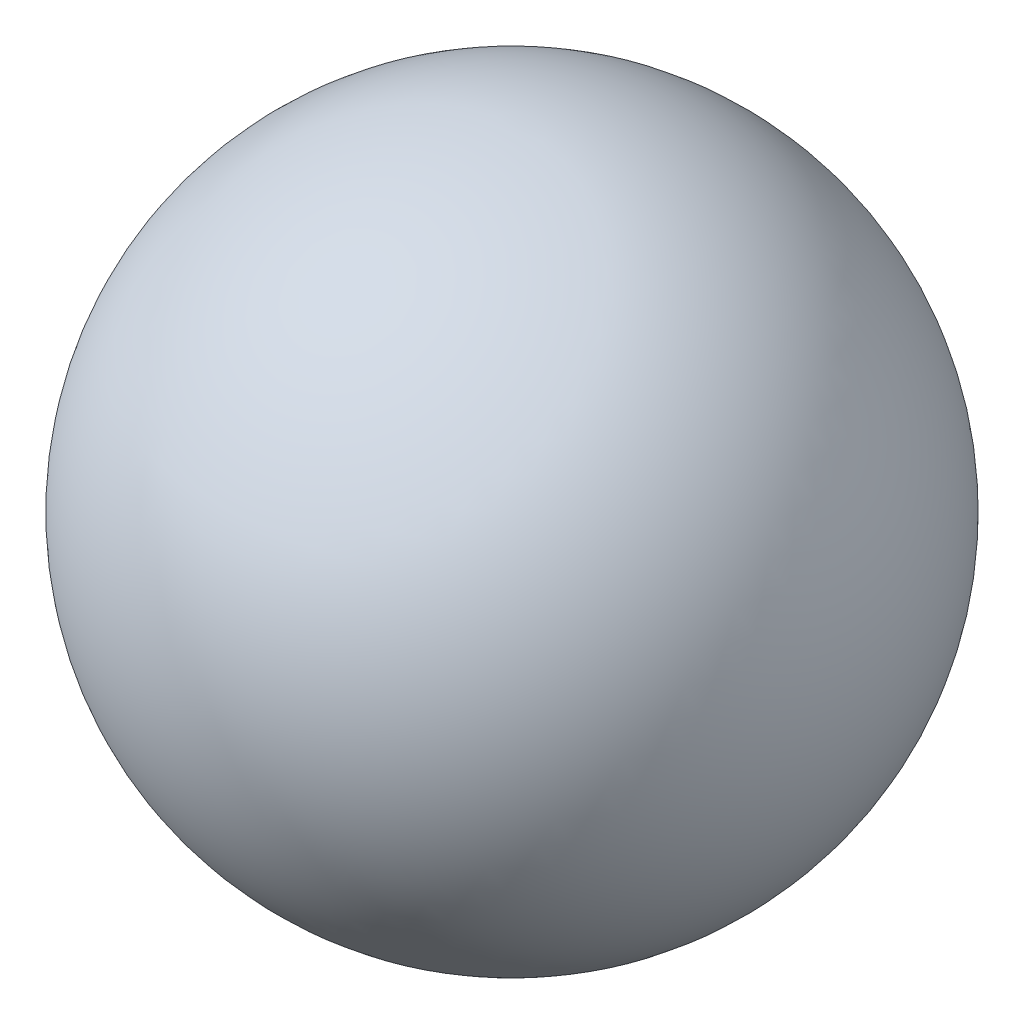
ISO-10303-21;
HEADER;
FILE_DESCRIPTION(('STEP AP214'),'2;1');
FILE_NAME('part.step','',(''),(''),'','','');
FILE_SCHEMA(('AUTOMOTIVE_DESIGN { 1 0 10303 214 1 1 1 1 }'));
ENDSEC;
DATA;
#1=APPLICATION_CONTEXT('core data for automotive mechanical design processes');
#2=APPLICATION_PROTOCOL_DEFINITION('international standard','automotive_design',2000,#1);
#3=PRODUCT_CONTEXT('',#1,'mechanical');
#4=PRODUCT('Part','Part','',(#3));
#5=PRODUCT_RELATED_PRODUCT_CATEGORY('part','',(#4));
#6=PRODUCT_DEFINITION_FORMATION('','',#4);
#7=PRODUCT_DEFINITION_CONTEXT('part definition',#1,'design');
#8=PRODUCT_DEFINITION('design','',#6,#7);
#9=PRODUCT_DEFINITION_SHAPE('','',#8);
#10=(LENGTH_UNIT() NAMED_UNIT(*) SI_UNIT(.MILLI.,.METRE.));
#11=(NAMED_UNIT(*) PLANE_ANGLE_UNIT() SI_UNIT($,.RADIAN.));
#12=(NAMED_UNIT(*) SI_UNIT($,.STERADIAN.) SOLID_ANGLE_UNIT());
#13=UNCERTAINTY_MEASURE_WITH_UNIT(LENGTH_MEASURE(1.E-05),#10,'distance_accuracy_value','');
#14=(GEOMETRIC_REPRESENTATION_CONTEXT(3) GLOBAL_UNCERTAINTY_ASSIGNED_CONTEXT((#13)) GLOBAL_UNIT_ASSIGNED_CONTEXT((#10,
#11,#12)) REPRESENTATION_CONTEXT('',''));
#15=CARTESIAN_POINT('',(0.,0.,0.));
#16=DIRECTION('',(0.,0.,1.));
#17=DIRECTION('',(1.,0.,0.));
#18=AXIS2_PLACEMENT_3D('',#15,#16,#17);
#19=CARTESIAN_POINT('',(0.,19.5,0.));
#20=DIRECTION('',(0.,-1.,0.));
#21=DIRECTION('',(-1.,0.,0.));
#22=AXIS2_PLACEMENT_3D('',#19,#20,#21);
#23=SPHERICAL_SURFACE('',#22,19.5);
#24=CARTESIAN_POINT('',(0.,0.,0.));
#25=VERTEX_POINT('',#24);
#26=VERTEX_LOOP('',#25);
#27=FACE_BOUND('',#26,.T.);
#28=ADVANCED_FACE('F28',(#27),#23,.T.);
#29=CLOSED_SHELL('',(#28));
#30=MANIFOLD_SOLID_BREP('B2',#29);
#31=ADVANCED_BREP_SHAPE_REPRESENTATION('',(#18,#30),#14);
#32=SHAPE_DEFINITION_REPRESENTATION(#9,#31);
ENDSEC;
END-ISO-10303-21;
